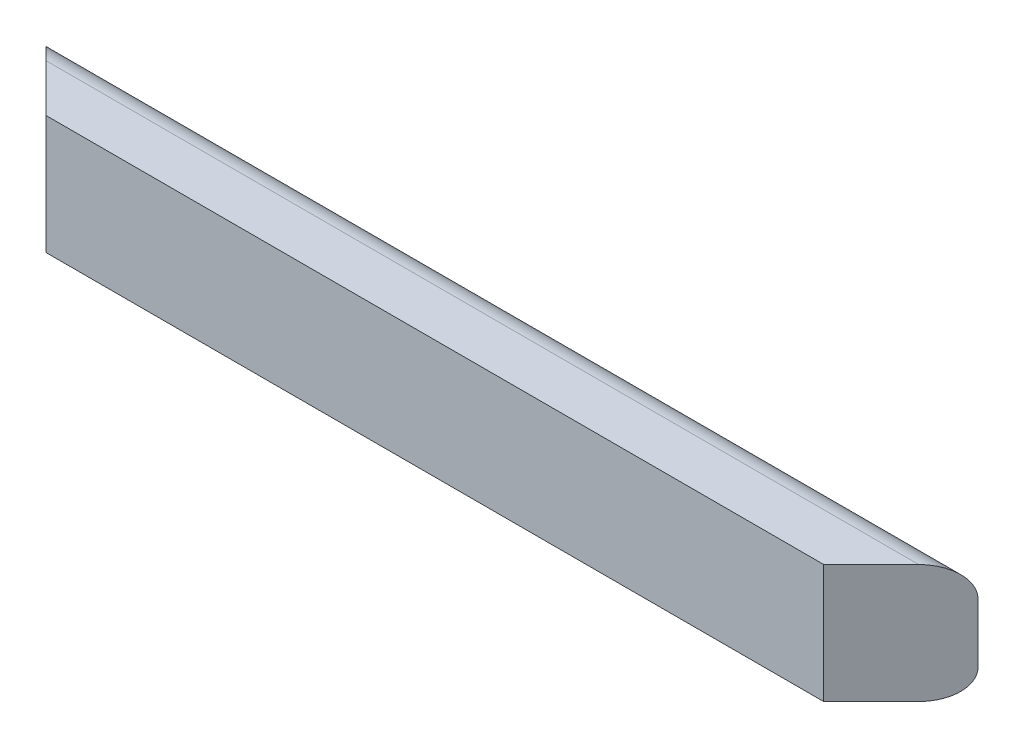
ISO-10303-21;
HEADER;
FILE_DESCRIPTION(('STEP AP214'),'2;1');
FILE_NAME('part.step','',(''),(''),'','','');
FILE_SCHEMA(('AUTOMOTIVE_DESIGN { 1 0 10303 214 1 1 1 1 }'));
ENDSEC;
DATA;
#1=APPLICATION_CONTEXT('core data for automotive mechanical design processes');
#2=APPLICATION_PROTOCOL_DEFINITION('international standard','automotive_design',2000,#1);
#3=PRODUCT_CONTEXT('',#1,'mechanical');
#4=PRODUCT('Part','Part','',(#3));
#5=PRODUCT_RELATED_PRODUCT_CATEGORY('part','',(#4));
#6=PRODUCT_DEFINITION_FORMATION('','',#4);
#7=PRODUCT_DEFINITION_CONTEXT('part definition',#1,'design');
#8=PRODUCT_DEFINITION('design','',#6,#7);
#9=PRODUCT_DEFINITION_SHAPE('','',#8);
#10=(LENGTH_UNIT() NAMED_UNIT(*) SI_UNIT(.MILLI.,.METRE.));
#11=(NAMED_UNIT(*) PLANE_ANGLE_UNIT() SI_UNIT($,.RADIAN.));
#12=(NAMED_UNIT(*) SI_UNIT($,.STERADIAN.) SOLID_ANGLE_UNIT());
#13=UNCERTAINTY_MEASURE_WITH_UNIT(LENGTH_MEASURE(1.E-05),#10,'distance_accuracy_value','');
#14=(GEOMETRIC_REPRESENTATION_CONTEXT(3) GLOBAL_UNCERTAINTY_ASSIGNED_CONTEXT((#13)) GLOBAL_UNIT_ASSIGNED_CONTEXT((#10,
#11,#12)) REPRESENTATION_CONTEXT('',''));
#15=CARTESIAN_POINT('',(0.,0.,0.));
#16=DIRECTION('',(0.,0.,1.));
#17=DIRECTION('',(1.,0.,0.));
#18=AXIS2_PLACEMENT_3D('',#15,#16,#17);
#19=CARTESIAN_POINT('',(996.95,0.,0.));
#20=DIRECTION('',(0.,1.,0.));
#21=DIRECTION('',(0.,0.,1.));
#22=AXIS2_PLACEMENT_3D('',#19,#20,#21);
#23=PLANE('',#22);
#24=DIRECTION('',(-1.,0.,0.));
#25=VECTOR('',#24,1.);
#26=CARTESIAN_POINT('',(996.95,0.,19.05));
#27=LINE('',#26,#25);
#28=CARTESIAN_POINT('',(914.4,0.,19.05));
#29=VERTEX_POINT('',#28);
#30=CARTESIAN_POINT('',(82.5499999999999,0.,19.05));
#31=VERTEX_POINT('',#30);
#32=EDGE_CURVE('E133',#29,#31,#27,.T.);
#33=ORIENTED_EDGE('',*,*,#32,.T.);
#34=DIRECTION('',(-0.707106781186549,0.,-0.707106781186546));
#35=VECTOR('',#34,1.);
#36=CARTESIAN_POINT('',(530.225000000001,0.,466.725));
#37=LINE('',#36,#35);
#38=CARTESIAN_POINT('',(31.7499999999996,0.,-31.7500000000001));
#39=VERTEX_POINT('',#38);
#40=EDGE_CURVE('E116',#31,#39,#37,.T.);
#41=ORIENTED_EDGE('',*,*,#40,.T.);
#42=DIRECTION('',(-1.,0.,0.));
#43=VECTOR('',#42,1.);
#44=CARTESIAN_POINT('',(996.95,0.,-31.75));
#45=LINE('',#44,#43);
#46=CARTESIAN_POINT('',(965.2,0.,-31.75));
#47=VERTEX_POINT('',#46);
#48=EDGE_CURVE('E11',#47,#39,#45,.T.);
#49=ORIENTED_EDGE('',*,*,#48,.F.);
#50=DIRECTION('',(-0.707106781186549,0.,0.707106781186546));
#51=VECTOR('',#50,1.);
#52=CARTESIAN_POINT('',(965.2,0.,-31.7499999999999));
#53=LINE('',#52,#51);
#54=EDGE_CURVE('E141',#47,#29,#53,.T.);
#55=ORIENTED_EDGE('',*,*,#54,.T.);
#56=EDGE_LOOP('',(#33,#41,#49,#55));
#57=FACE_BOUND('',#56,.T.);
#58=ADVANCED_FACE('F38',(#57),#23,.F.);
#59=CARTESIAN_POINT('',(996.95,31.75,-31.75));
#60=DIRECTION('',(-1.,0.,0.));
#61=DIRECTION('',(0.,0.,1.));
#62=AXIS2_PLACEMENT_3D('',#59,#60,#61);
#63=CYLINDRICAL_SURFACE('',#62,31.75);
#64=ORIENTED_EDGE('',*,*,#48,.T.);
#65=CARTESIAN_POINT('',(31.7499999999997,31.75,-31.75));
#66=DIRECTION('',(0.707106781186546,0.,-0.707106781186549));
#67=DIRECTION('',(-0.707106781186549,0.,-0.707106781186546));
#68=AXIS2_PLACEMENT_3D('',#65,#66,#67);
#69=ELLIPSE('',#68,44.9012806053458,31.75);
#70=CARTESIAN_POINT('',(0.,31.75,-63.4999999999996));
#71=VERTEX_POINT('',#70);
#72=EDGE_CURVE('E99',#39,#71,#69,.T.);
#73=ORIENTED_EDGE('',*,*,#72,.T.);
#74=DIRECTION('',(-1.,0.,0.));
#75=VECTOR('',#74,1.);
#76=CARTESIAN_POINT('',(996.95,31.75,-63.5));
#77=LINE('',#76,#75);
#78=CARTESIAN_POINT('',(996.95,31.75,-63.5));
#79=VERTEX_POINT('',#78);
#80=EDGE_CURVE('E47',#79,#71,#77,.T.);
#81=ORIENTED_EDGE('',*,*,#80,.F.);
#82=CARTESIAN_POINT('',(965.2,31.75,-31.75));
#83=DIRECTION('',(-0.707106781186546,0.,-0.707106781186549));
#84=DIRECTION('',(-0.707106781186549,0.,0.707106781186546));
#85=AXIS2_PLACEMENT_3D('',#82,#83,#84);
#86=ELLIPSE('',#85,44.9012806053458,31.75);
#87=EDGE_CURVE('E55',#79,#47,#86,.T.);
#88=ORIENTED_EDGE('',*,*,#87,.T.);
#89=EDGE_LOOP('',(#64,#73,#81,#88));
#90=FACE_BOUND('',#89,.T.);
#91=ADVANCED_FACE('F111',(#90),#63,.T.);
#92=CARTESIAN_POINT('',(996.95,95.25,-63.5));
#93=DIRECTION('',(0.,0.,1.));
#94=DIRECTION('',(1.,0.,0.));
#95=AXIS2_PLACEMENT_3D('',#92,#93,#94);
#96=PLANE('',#95);
#97=DIRECTION('',(0.,1.,0.));
#98=VECTOR('',#97,1.);
#99=CARTESIAN_POINT('',(0.,95.25,-63.5));
#100=LINE('',#99,#98);
#101=CARTESIAN_POINT('',(0.,95.25,-63.5));
#102=VERTEX_POINT('',#101);
#103=EDGE_CURVE('E96',#71,#102,#100,.T.);
#104=ORIENTED_EDGE('',*,*,#103,.T.);
#105=DIRECTION('',(-1.,0.,0.));
#106=VECTOR('',#105,1.);
#107=CARTESIAN_POINT('',(996.95,95.25,-63.5));
#108=LINE('',#107,#106);
#109=CARTESIAN_POINT('',(996.95,95.25,-63.4999999999996));
#110=VERTEX_POINT('',#109);
#111=EDGE_CURVE('E120',#110,#102,#108,.T.);
#112=ORIENTED_EDGE('',*,*,#111,.F.);
#113=DIRECTION('',(0.,1.,0.));
#114=VECTOR('',#113,1.);
#115=CARTESIAN_POINT('',(996.95,95.25,-63.5));
#116=LINE('',#115,#114);
#117=EDGE_CURVE('E108',#79,#110,#116,.T.);
#118=ORIENTED_EDGE('',*,*,#117,.F.);
#119=ORIENTED_EDGE('',*,*,#80,.T.);
#120=EDGE_LOOP('',(#104,#112,#118,#119));
#121=FACE_BOUND('',#120,.T.);
#122=ADVANCED_FACE('F118',(#121),#96,.F.);
#123=CARTESIAN_POINT('',(996.95,95.25,-31.75));
#124=DIRECTION('',(-1.,0.,0.));
#125=DIRECTION('',(0.,0.,1.));
#126=AXIS2_PLACEMENT_3D('',#123,#124,#125);
#127=CYLINDRICAL_SURFACE('',#126,31.75);
#128=ORIENTED_EDGE('',*,*,#111,.T.);
#129=CARTESIAN_POINT('',(31.7499999999997,95.25,-31.75));
#130=DIRECTION('',(0.707106781186546,0.,-0.707106781186549));
#131=DIRECTION('',(-0.707106781186549,0.,-0.707106781186546));
#132=AXIS2_PLACEMENT_3D('',#129,#130,#131);
#133=ELLIPSE('',#132,44.9012806053458,31.75);
#134=CARTESIAN_POINT('',(31.7499999999997,127.,-31.75));
#135=VERTEX_POINT('',#134);
#136=EDGE_CURVE('E102',#102,#135,#133,.T.);
#137=ORIENTED_EDGE('',*,*,#136,.T.);
#138=DIRECTION('',(-1.,0.,0.));
#139=VECTOR('',#138,1.);
#140=CARTESIAN_POINT('',(996.95,127.,-31.75));
#141=LINE('',#140,#139);
#142=CARTESIAN_POINT('',(965.2,127.,-31.75));
#143=VERTEX_POINT('',#142);
#144=EDGE_CURVE('E123',#143,#135,#141,.T.);
#145=ORIENTED_EDGE('',*,*,#144,.F.);
#146=CARTESIAN_POINT('',(965.2,95.25,-31.75));
#147=DIRECTION('',(-0.707106781186546,0.,-0.707106781186549));
#148=DIRECTION('',(-0.707106781186549,0.,0.707106781186546));
#149=AXIS2_PLACEMENT_3D('',#146,#147,#148);
#150=ELLIPSE('',#149,44.9012806053458,31.75);
#151=EDGE_CURVE('E115',#143,#110,#150,.T.);
#152=ORIENTED_EDGE('',*,*,#151,.T.);
#153=EDGE_LOOP('',(#128,#137,#145,#152));
#154=FACE_BOUND('',#153,.T.);
#155=ADVANCED_FACE('F167',(#154),#127,.T.);
#156=CARTESIAN_POINT('',(996.95,127.,19.05));
#157=DIRECTION('',(0.,-1.,0.));
#158=DIRECTION('',(0.,0.,-1.));
#159=AXIS2_PLACEMENT_3D('',#156,#157,#158);
#160=PLANE('',#159);
#161=ORIENTED_EDGE('',*,*,#144,.T.);
#162=DIRECTION('',(0.707106781186549,0.,0.707106781186546));
#163=VECTOR('',#162,1.);
#164=CARTESIAN_POINT('',(539.750000000001,127.000000000001,476.25));
#165=LINE('',#164,#163);
#166=CARTESIAN_POINT('',(82.5500000000001,127.,19.05));
#167=VERTEX_POINT('',#166);
#168=EDGE_CURVE('E161',#135,#167,#165,.T.);
#169=ORIENTED_EDGE('',*,*,#168,.T.);
#170=DIRECTION('',(-1.,0.,0.));
#171=VECTOR('',#170,1.);
#172=CARTESIAN_POINT('',(996.95,127.,19.05));
#173=LINE('',#172,#171);
#174=CARTESIAN_POINT('',(914.4,127.,19.05));
#175=VERTEX_POINT('',#174);
#176=EDGE_CURVE('E129',#175,#167,#173,.T.);
#177=ORIENTED_EDGE('',*,*,#176,.F.);
#178=DIRECTION('',(0.707106781186549,0.,-0.707106781186546));
#179=VECTOR('',#178,1.);
#180=CARTESIAN_POINT('',(955.675,127.,-22.2249999999999));
#181=LINE('',#180,#179);
#182=EDGE_CURVE('E149',#175,#143,#181,.T.);
#183=ORIENTED_EDGE('',*,*,#182,.T.);
#184=EDGE_LOOP('',(#161,#169,#177,#183));
#185=FACE_BOUND('',#184,.T.);
#186=ADVANCED_FACE('F169',(#185),#160,.F.);
#187=CARTESIAN_POINT('',(996.95,0.,19.05));
#188=DIRECTION('',(0.,0.,-1.));
#189=DIRECTION('',(-1.,0.,0.));
#190=AXIS2_PLACEMENT_3D('',#187,#188,#189);
#191=PLANE('',#190);
#192=ORIENTED_EDGE('',*,*,#176,.T.);
#193=DIRECTION('',(0.,-1.,0.));
#194=VECTOR('',#193,1.);
#195=CARTESIAN_POINT('',(82.5499999999999,0.,19.05));
#196=LINE('',#195,#194);
#197=EDGE_CURVE('E158',#167,#31,#196,.T.);
#198=ORIENTED_EDGE('',*,*,#197,.T.);
#199=ORIENTED_EDGE('',*,*,#32,.F.);
#200=DIRECTION('',(0.,1.,0.));
#201=VECTOR('',#200,1.);
#202=CARTESIAN_POINT('',(914.4,0.,19.05));
#203=LINE('',#202,#201);
#204=EDGE_CURVE('E145',#29,#175,#203,.T.);
#205=ORIENTED_EDGE('',*,*,#204,.T.);
#206=EDGE_LOOP('',(#192,#198,#199,#205));
#207=FACE_BOUND('',#206,.T.);
#208=ADVANCED_FACE('F174',(#207),#191,.F.);
#209=CARTESIAN_POINT('',(466.724999999999,0.,466.725));
#210=DIRECTION('',(-0.707106781186546,0.,-0.707106781186549));
#211=DIRECTION('',(-0.707106781186549,0.,0.707106781186546));
#212=AXIS2_PLACEMENT_3D('',#209,#210,#211);
#213=PLANE('',#212);
#214=ORIENTED_EDGE('',*,*,#117,.T.);
#215=ORIENTED_EDGE('',*,*,#151,.F.);
#216=ORIENTED_EDGE('',*,*,#182,.F.);
#217=ORIENTED_EDGE('',*,*,#204,.F.);
#218=ORIENTED_EDGE('',*,*,#54,.F.);
#219=ORIENTED_EDGE('',*,*,#87,.F.);
#220=EDGE_LOOP('',(#214,#215,#216,#217,#218,#219));
#221=FACE_BOUND('',#220,.T.);
#222=ADVANCED_FACE('F171',(#221),#213,.F.);
#223=CARTESIAN_POINT('',(530.225000000001,0.,466.725));
#224=DIRECTION('',(0.707106781186546,0.,-0.707106781186549));
#225=DIRECTION('',(0.707106781186549,0.,0.707106781186546));
#226=AXIS2_PLACEMENT_3D('',#223,#224,#225);
#227=PLANE('',#226);
#228=ORIENTED_EDGE('',*,*,#40,.F.);
#229=ORIENTED_EDGE('',*,*,#197,.F.);
#230=ORIENTED_EDGE('',*,*,#168,.F.);
#231=ORIENTED_EDGE('',*,*,#136,.F.);
#232=ORIENTED_EDGE('',*,*,#103,.F.);
#233=ORIENTED_EDGE('',*,*,#72,.F.);
#234=EDGE_LOOP('',(#228,#229,#230,#231,#232,#233));
#235=FACE_BOUND('',#234,.T.);
#236=ADVANCED_FACE('F98',(#235),#227,.F.);
#237=CLOSED_SHELL('',(#58,#91,#122,#155,#186,#208,#222,#236));
#238=MANIFOLD_SOLID_BREP('B2',#237);
#239=ADVANCED_BREP_SHAPE_REPRESENTATION('',(#18,#238),#14);
#240=SHAPE_DEFINITION_REPRESENTATION(#9,#239);
ENDSEC;
END-ISO-10303-21;
